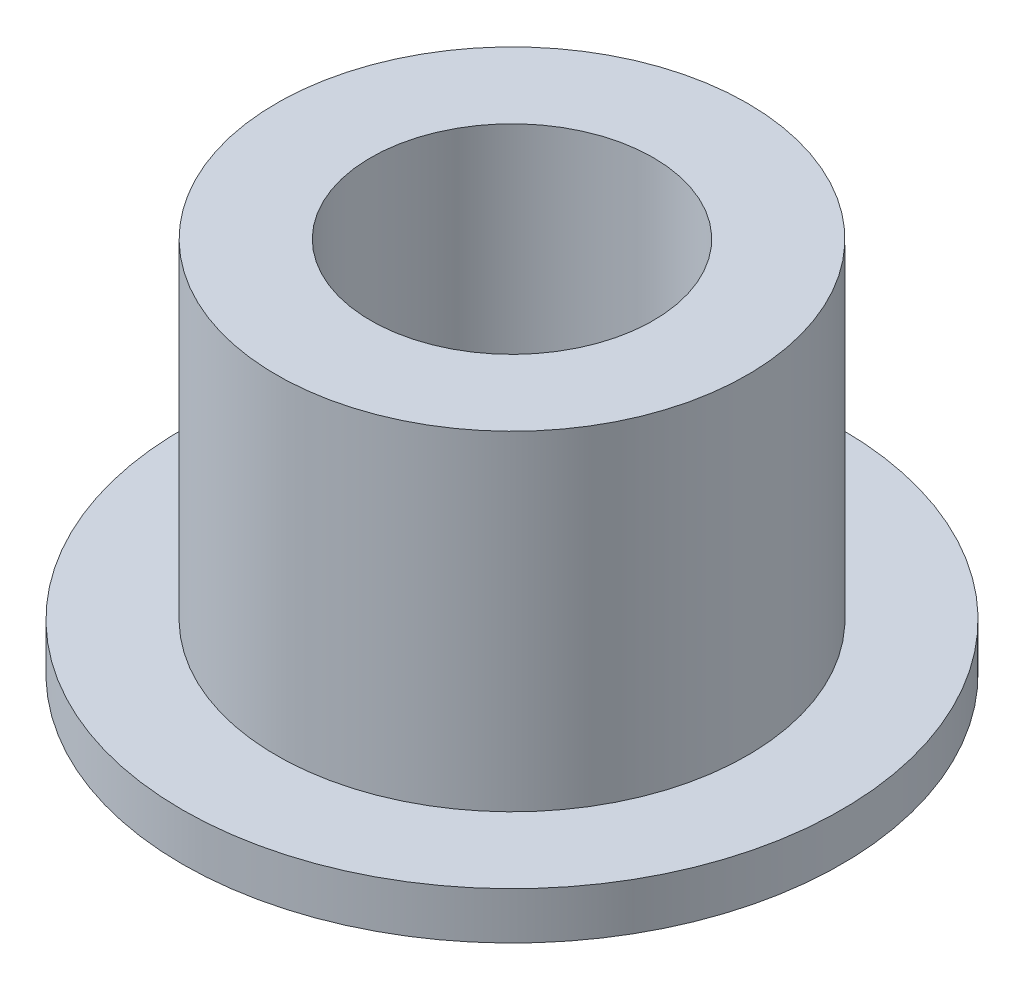
ISO-10303-21;
HEADER;
FILE_DESCRIPTION(('STEP AP214'),'2;1');
FILE_NAME('part.step','',(''),(''),'','','');
FILE_SCHEMA(('AUTOMOTIVE_DESIGN { 1 0 10303 214 1 1 1 1 }'));
ENDSEC;
DATA;
#1=APPLICATION_CONTEXT('core data for automotive mechanical design processes');
#2=APPLICATION_PROTOCOL_DEFINITION('international standard','automotive_design',2000,#1);
#3=PRODUCT_CONTEXT('',#1,'mechanical');
#4=PRODUCT('Part','Part','',(#3));
#5=PRODUCT_RELATED_PRODUCT_CATEGORY('part','',(#4));
#6=PRODUCT_DEFINITION_FORMATION('','',#4);
#7=PRODUCT_DEFINITION_CONTEXT('part definition',#1,'design');
#8=PRODUCT_DEFINITION('design','',#6,#7);
#9=PRODUCT_DEFINITION_SHAPE('','',#8);
#10=(LENGTH_UNIT() NAMED_UNIT(*) SI_UNIT(.MILLI.,.METRE.));
#11=(NAMED_UNIT(*) PLANE_ANGLE_UNIT() SI_UNIT($,.RADIAN.));
#12=(NAMED_UNIT(*) SI_UNIT($,.STERADIAN.) SOLID_ANGLE_UNIT());
#13=UNCERTAINTY_MEASURE_WITH_UNIT(LENGTH_MEASURE(1.E-05),#10,'distance_accuracy_value','');
#14=(GEOMETRIC_REPRESENTATION_CONTEXT(3) GLOBAL_UNCERTAINTY_ASSIGNED_CONTEXT((#13)) GLOBAL_UNIT_ASSIGNED_CONTEXT((#10,
#11,#12)) REPRESENTATION_CONTEXT('',''));
#15=CARTESIAN_POINT('',(0.,0.,0.));
#16=DIRECTION('',(0.,0.,1.));
#17=DIRECTION('',(1.,0.,0.));
#18=AXIS2_PLACEMENT_3D('',#15,#16,#17);
#19=CARTESIAN_POINT('',(0.,12.7,0.));
#20=DIRECTION('',(0.,-1.,0.));
#21=DIRECTION('',(0.,0.,-1.));
#22=AXIS2_PLACEMENT_3D('',#19,#20,#21);
#23=CYLINDRICAL_SURFACE('',#22,7.9375);
#24=CARTESIAN_POINT('',(0.,1.5875,0.));
#25=DIRECTION('',(0.,-1.,0.));
#26=DIRECTION('',(0.,0.,-1.));
#27=AXIS2_PLACEMENT_3D('',#24,#25,#26);
#28=CIRCLE('',#27,7.9375);
#29=CARTESIAN_POINT('',(0.,1.5875,-7.9375));
#30=VERTEX_POINT('',#29);
#31=EDGE_CURVE('E33',#30,#30,#28,.T.);
#32=ORIENTED_EDGE('',*,*,#31,.F.);
#33=EDGE_LOOP('',(#32));
#34=FACE_BOUND('',#33,.T.);
#35=CARTESIAN_POINT('',(0.,12.7,0.));
#36=DIRECTION('',(0.,-1.,0.));
#37=DIRECTION('',(0.,0.,-1.));
#38=AXIS2_PLACEMENT_3D('',#35,#36,#37);
#39=CIRCLE('',#38,7.9375);
#40=CARTESIAN_POINT('',(0.,12.7,-7.9375));
#41=VERTEX_POINT('',#40);
#42=EDGE_CURVE('E17',#41,#41,#39,.F.);
#43=ORIENTED_EDGE('',*,*,#42,.F.);
#44=EDGE_LOOP('',(#43));
#45=FACE_BOUND('',#44,.T.);
#46=ADVANCED_FACE('F14',(#34,#45),#23,.T.);
#47=CARTESIAN_POINT('',(0.,12.7,0.));
#48=DIRECTION('',(0.,1.,0.));
#49=DIRECTION('',(0.,0.,1.));
#50=AXIS2_PLACEMENT_3D('',#47,#48,#49);
#51=PLANE('',#50);
#52=CARTESIAN_POINT('',(0.,12.7,0.));
#53=DIRECTION('',(0.,-1.,0.));
#54=DIRECTION('',(0.,0.,-1.));
#55=AXIS2_PLACEMENT_3D('',#52,#53,#54);
#56=CIRCLE('',#55,4.7625);
#57=CARTESIAN_POINT('',(0.,12.7,-4.7625));
#58=VERTEX_POINT('',#57);
#59=EDGE_CURVE('E31',#58,#58,#56,.T.);
#60=ORIENTED_EDGE('',*,*,#59,.T.);
#61=EDGE_LOOP('',(#60));
#62=FACE_BOUND('',#61,.T.);
#63=ORIENTED_EDGE('',*,*,#42,.T.);
#64=EDGE_LOOP('',(#63));
#65=FACE_BOUND('',#64,.T.);
#66=ADVANCED_FACE('F40',(#62,#65),#51,.T.);
#67=CARTESIAN_POINT('',(0.,1.5875,0.));
#68=DIRECTION('',(0.,1.,0.));
#69=DIRECTION('',(0.,0.,1.));
#70=AXIS2_PLACEMENT_3D('',#67,#68,#69);
#71=PLANE('',#70);
#72=ORIENTED_EDGE('',*,*,#31,.T.);
#73=EDGE_LOOP('',(#72));
#74=FACE_BOUND('',#73,.T.);
#75=CARTESIAN_POINT('',(0.,1.5875,0.));
#76=DIRECTION('',(0.,-1.,0.));
#77=DIRECTION('',(0.,0.,-1.));
#78=AXIS2_PLACEMENT_3D('',#75,#76,#77);
#79=CIRCLE('',#78,11.1125);
#80=CARTESIAN_POINT('',(0.,1.5875,-11.1125));
#81=VERTEX_POINT('',#80);
#82=EDGE_CURVE('E26',#81,#81,#79,.T.);
#83=ORIENTED_EDGE('',*,*,#82,.F.);
#84=EDGE_LOOP('',(#83));
#85=FACE_BOUND('',#84,.T.);
#86=ADVANCED_FACE('F48',(#74,#85),#71,.T.);
#87=CARTESIAN_POINT('',(0.,12.7,0.));
#88=DIRECTION('',(0.,-1.,0.));
#89=DIRECTION('',(0.,0.,-1.));
#90=AXIS2_PLACEMENT_3D('',#87,#88,#89);
#91=CYLINDRICAL_SURFACE('',#90,4.7625);
#92=CARTESIAN_POINT('',(0.,0.,0.));
#93=DIRECTION('',(0.,-1.,0.));
#94=DIRECTION('',(0.,0.,-1.));
#95=AXIS2_PLACEMENT_3D('',#92,#93,#94);
#96=CIRCLE('',#95,4.7625);
#97=CARTESIAN_POINT('',(0.,0.,-4.7625));
#98=VERTEX_POINT('',#97);
#99=EDGE_CURVE('E21',#98,#98,#96,.T.);
#100=ORIENTED_EDGE('',*,*,#99,.T.);
#101=EDGE_LOOP('',(#100));
#102=FACE_BOUND('',#101,.T.);
#103=ORIENTED_EDGE('',*,*,#59,.F.);
#104=EDGE_LOOP('',(#103));
#105=FACE_BOUND('',#104,.T.);
#106=ADVANCED_FACE('F58',(#102,#105),#91,.F.);
#107=CARTESIAN_POINT('',(0.,1.5875,0.));
#108=DIRECTION('',(0.,-1.,0.));
#109=DIRECTION('',(0.,0.,-1.));
#110=AXIS2_PLACEMENT_3D('',#107,#108,#109);
#111=CYLINDRICAL_SURFACE('',#110,11.1125);
#112=ORIENTED_EDGE('',*,*,#82,.T.);
#113=EDGE_LOOP('',(#112));
#114=FACE_BOUND('',#113,.T.);
#115=CARTESIAN_POINT('',(0.,0.,0.));
#116=DIRECTION('',(0.,-1.,0.));
#117=DIRECTION('',(0.,0.,-1.));
#118=AXIS2_PLACEMENT_3D('',#115,#116,#117);
#119=CIRCLE('',#118,11.1125);
#120=CARTESIAN_POINT('',(0.,0.,-11.1125));
#121=VERTEX_POINT('',#120);
#122=EDGE_CURVE('E10',#121,#121,#119,.F.);
#123=ORIENTED_EDGE('',*,*,#122,.T.);
#124=EDGE_LOOP('',(#123));
#125=FACE_BOUND('',#124,.T.);
#126=ADVANCED_FACE('F52',(#114,#125),#111,.T.);
#127=CARTESIAN_POINT('',(0.,0.,0.));
#128=DIRECTION('',(0.,1.,0.));
#129=DIRECTION('',(0.,0.,1.));
#130=AXIS2_PLACEMENT_3D('',#127,#128,#129);
#131=PLANE('',#130);
#132=ORIENTED_EDGE('',*,*,#122,.F.);
#133=EDGE_LOOP('',(#132));
#134=FACE_BOUND('',#133,.T.);
#135=ORIENTED_EDGE('',*,*,#99,.F.);
#136=EDGE_LOOP('',(#135));
#137=FACE_BOUND('',#136,.T.);
#138=ADVANCED_FACE('F50',(#134,#137),#131,.F.);
#139=CLOSED_SHELL('',(#46,#66,#86,#106,#126,#138));
#140=MANIFOLD_SOLID_BREP('B1',#139);
#141=ADVANCED_BREP_SHAPE_REPRESENTATION('',(#18,#140),#14);
#142=SHAPE_DEFINITION_REPRESENTATION(#9,#141);
ENDSEC;
END-ISO-10303-21;
